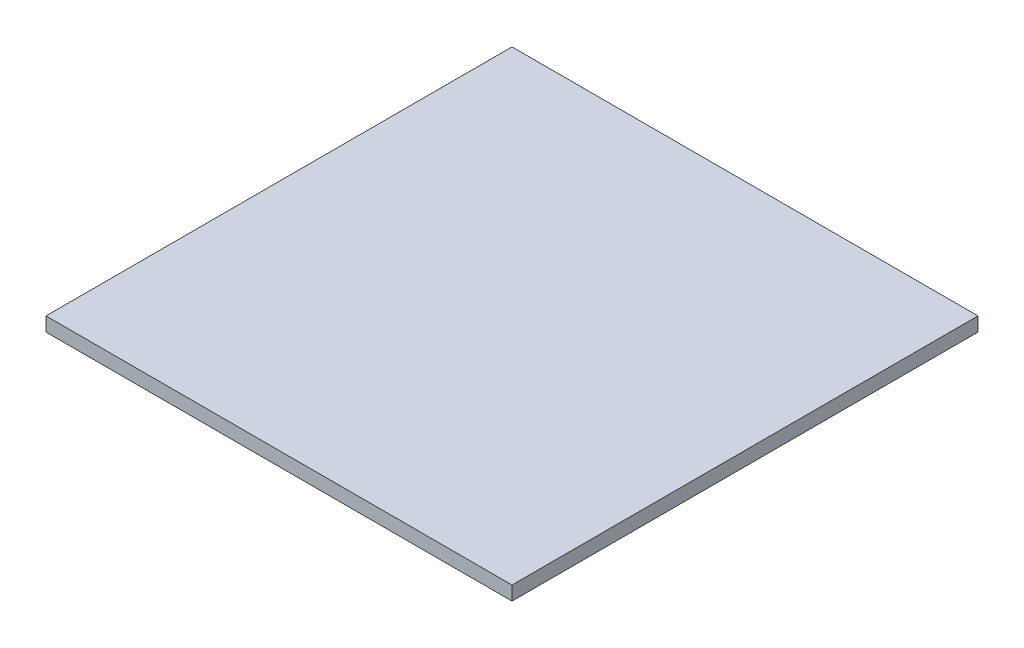
ISO-10303-21;
HEADER;
FILE_DESCRIPTION(('STEP AP214'),'2;1');
FILE_NAME('part.step','',(''),(''),'','','');
FILE_SCHEMA(('AUTOMOTIVE_DESIGN { 1 0 10303 214 1 1 1 1 }'));
ENDSEC;
DATA;
#1=APPLICATION_CONTEXT('core data for automotive mechanical design processes');
#2=APPLICATION_PROTOCOL_DEFINITION('international standard','automotive_design',2000,#1);
#3=PRODUCT_CONTEXT('',#1,'mechanical');
#4=PRODUCT('Part','Part','',(#3));
#5=PRODUCT_RELATED_PRODUCT_CATEGORY('part','',(#4));
#6=PRODUCT_DEFINITION_FORMATION('','',#4);
#7=PRODUCT_DEFINITION_CONTEXT('part definition',#1,'design');
#8=PRODUCT_DEFINITION('design','',#6,#7);
#9=PRODUCT_DEFINITION_SHAPE('','',#8);
#10=(LENGTH_UNIT() NAMED_UNIT(*) SI_UNIT(.MILLI.,.METRE.));
#11=(NAMED_UNIT(*) PLANE_ANGLE_UNIT() SI_UNIT($,.RADIAN.));
#12=(NAMED_UNIT(*) SI_UNIT($,.STERADIAN.) SOLID_ANGLE_UNIT());
#13=UNCERTAINTY_MEASURE_WITH_UNIT(LENGTH_MEASURE(1.E-05),#10,'distance_accuracy_value','');
#14=(GEOMETRIC_REPRESENTATION_CONTEXT(3) GLOBAL_UNCERTAINTY_ASSIGNED_CONTEXT((#13)) GLOBAL_UNIT_ASSIGNED_CONTEXT((#10,
#11,#12)) REPRESENTATION_CONTEXT('',''));
#15=CARTESIAN_POINT('',(0.,0.,0.));
#16=DIRECTION('',(0.,0.,1.));
#17=DIRECTION('',(1.,0.,0.));
#18=AXIS2_PLACEMENT_3D('',#15,#16,#17);
#19=CARTESIAN_POINT('',(50.,3.,50.));
#20=DIRECTION('',(-1.,0.,0.));
#21=DIRECTION('',(0.,0.,1.));
#22=AXIS2_PLACEMENT_3D('',#19,#20,#21);
#23=PLANE('',#22);
#24=DIRECTION('',(0.,0.,-1.));
#25=VECTOR('',#24,1.);
#26=CARTESIAN_POINT('',(50.,0.,50.));
#27=LINE('',#26,#25);
#28=CARTESIAN_POINT('',(50.,0.,50.));
#29=VERTEX_POINT('',#28);
#30=CARTESIAN_POINT('',(50.,0.,-50.));
#31=VERTEX_POINT('',#30);
#32=EDGE_CURVE('E96',#29,#31,#27,.T.);
#33=ORIENTED_EDGE('',*,*,#32,.T.);
#34=DIRECTION('',(0.,-1.,0.));
#35=VECTOR('',#34,1.);
#36=CARTESIAN_POINT('',(50.,3.,-50.));
#37=LINE('',#36,#35);
#38=CARTESIAN_POINT('',(50.,3.,-50.));
#39=VERTEX_POINT('',#38);
#40=EDGE_CURVE('E11',#39,#31,#37,.T.);
#41=ORIENTED_EDGE('',*,*,#40,.F.);
#42=DIRECTION('',(0.,0.,-1.));
#43=VECTOR('',#42,1.);
#44=CARTESIAN_POINT('',(50.,3.,50.));
#45=LINE('',#44,#43);
#46=CARTESIAN_POINT('',(50.,3.,50.));
#47=VERTEX_POINT('',#46);
#48=EDGE_CURVE('E84',#47,#39,#45,.T.);
#49=ORIENTED_EDGE('',*,*,#48,.F.);
#50=DIRECTION('',(0.,-1.,0.));
#51=VECTOR('',#50,1.);
#52=CARTESIAN_POINT('',(50.,3.,50.));
#53=LINE('',#52,#51);
#54=EDGE_CURVE('E92',#47,#29,#53,.T.);
#55=ORIENTED_EDGE('',*,*,#54,.T.);
#56=EDGE_LOOP('',(#33,#41,#49,#55));
#57=FACE_BOUND('',#56,.T.);
#58=ADVANCED_FACE('F33',(#57),#23,.F.);
#59=CARTESIAN_POINT('',(-50.,3.,-50.));
#60=DIRECTION('',(0.,0.,1.));
#61=DIRECTION('',(1.,0.,0.));
#62=AXIS2_PLACEMENT_3D('',#59,#60,#61);
#63=PLANE('',#62);
#64=DIRECTION('',(-1.,0.,0.));
#65=VECTOR('',#64,1.);
#66=CARTESIAN_POINT('',(-50.,0.,-50.));
#67=LINE('',#66,#65);
#68=CARTESIAN_POINT('',(-50.,0.,-50.));
#69=VERTEX_POINT('',#68);
#70=EDGE_CURVE('E88',#31,#69,#67,.T.);
#71=ORIENTED_EDGE('',*,*,#70,.T.);
#72=DIRECTION('',(0.,-1.,0.));
#73=VECTOR('',#72,1.);
#74=CARTESIAN_POINT('',(-50.,3.,-50.));
#75=LINE('',#74,#73);
#76=CARTESIAN_POINT('',(-50.,3.,-50.));
#77=VERTEX_POINT('',#76);
#78=EDGE_CURVE('E41',#77,#69,#75,.T.);
#79=ORIENTED_EDGE('',*,*,#78,.F.);
#80=DIRECTION('',(-1.,0.,0.));
#81=VECTOR('',#80,1.);
#82=CARTESIAN_POINT('',(-50.,3.,-50.));
#83=LINE('',#82,#81);
#84=EDGE_CURVE('E79',#39,#77,#83,.T.);
#85=ORIENTED_EDGE('',*,*,#84,.F.);
#86=ORIENTED_EDGE('',*,*,#40,.T.);
#87=EDGE_LOOP('',(#71,#79,#85,#86));
#88=FACE_BOUND('',#87,.T.);
#89=ADVANCED_FACE('F87',(#88),#63,.F.);
#90=CARTESIAN_POINT('',(-50.,3.,50.));
#91=DIRECTION('',(1.,0.,0.));
#92=DIRECTION('',(0.,0.,-1.));
#93=AXIS2_PLACEMENT_3D('',#90,#91,#92);
#94=PLANE('',#93);
#95=DIRECTION('',(0.,0.,1.));
#96=VECTOR('',#95,1.);
#97=CARTESIAN_POINT('',(-50.,0.,50.));
#98=LINE('',#97,#96);
#99=CARTESIAN_POINT('',(-50.,0.,50.));
#100=VERTEX_POINT('',#99);
#101=EDGE_CURVE('E66',#69,#100,#98,.T.);
#102=ORIENTED_EDGE('',*,*,#101,.T.);
#103=DIRECTION('',(0.,-1.,0.));
#104=VECTOR('',#103,1.);
#105=CARTESIAN_POINT('',(-50.,3.,50.));
#106=LINE('',#105,#104);
#107=CARTESIAN_POINT('',(-50.,3.,50.));
#108=VERTEX_POINT('',#107);
#109=EDGE_CURVE('E89',#108,#100,#106,.T.);
#110=ORIENTED_EDGE('',*,*,#109,.F.);
#111=DIRECTION('',(0.,0.,1.));
#112=VECTOR('',#111,1.);
#113=CARTESIAN_POINT('',(-50.,3.,50.));
#114=LINE('',#113,#112);
#115=EDGE_CURVE('E82',#77,#108,#114,.T.);
#116=ORIENTED_EDGE('',*,*,#115,.F.);
#117=ORIENTED_EDGE('',*,*,#78,.T.);
#118=EDGE_LOOP('',(#102,#110,#116,#117));
#119=FACE_BOUND('',#118,.T.);
#120=ADVANCED_FACE('F90',(#119),#94,.F.);
#121=CARTESIAN_POINT('',(-50.,3.,50.));
#122=DIRECTION('',(0.,0.,-1.));
#123=DIRECTION('',(-1.,0.,0.));
#124=AXIS2_PLACEMENT_3D('',#121,#122,#123);
#125=PLANE('',#124);
#126=DIRECTION('',(1.,0.,0.));
#127=VECTOR('',#126,1.);
#128=CARTESIAN_POINT('',(-50.,0.,50.));
#129=LINE('',#128,#127);
#130=EDGE_CURVE('E72',#100,#29,#129,.T.);
#131=ORIENTED_EDGE('',*,*,#130,.T.);
#132=ORIENTED_EDGE('',*,*,#54,.F.);
#133=DIRECTION('',(1.,0.,0.));
#134=VECTOR('',#133,1.);
#135=CARTESIAN_POINT('',(-50.,3.,50.));
#136=LINE('',#135,#134);
#137=EDGE_CURVE('E49',#108,#47,#136,.T.);
#138=ORIENTED_EDGE('',*,*,#137,.F.);
#139=ORIENTED_EDGE('',*,*,#109,.T.);
#140=EDGE_LOOP('',(#131,#132,#138,#139));
#141=FACE_BOUND('',#140,.T.);
#142=ADVANCED_FACE('F103',(#141),#125,.F.);
#143=CARTESIAN_POINT('',(0.,3.,0.));
#144=DIRECTION('',(0.,-1.,0.));
#145=DIRECTION('',(0.,0.,-1.));
#146=AXIS2_PLACEMENT_3D('',#143,#144,#145);
#147=PLANE('',#146);
#148=ORIENTED_EDGE('',*,*,#48,.T.);
#149=ORIENTED_EDGE('',*,*,#84,.T.);
#150=ORIENTED_EDGE('',*,*,#115,.T.);
#151=ORIENTED_EDGE('',*,*,#137,.T.);
#152=EDGE_LOOP('',(#148,#149,#150,#151));
#153=FACE_BOUND('',#152,.T.);
#154=ADVANCED_FACE('F80',(#153),#147,.F.);
#155=CARTESIAN_POINT('',(0.,0.,0.));
#156=DIRECTION('',(0.,-1.,0.));
#157=DIRECTION('',(0.,0.,-1.));
#158=AXIS2_PLACEMENT_3D('',#155,#156,#157);
#159=PLANE('',#158);
#160=ORIENTED_EDGE('',*,*,#32,.F.);
#161=ORIENTED_EDGE('',*,*,#130,.F.);
#162=ORIENTED_EDGE('',*,*,#101,.F.);
#163=ORIENTED_EDGE('',*,*,#70,.F.);
#164=EDGE_LOOP('',(#160,#161,#162,#163));
#165=FACE_BOUND('',#164,.T.);
#166=ADVANCED_FACE('F106',(#165),#159,.T.);
#167=CLOSED_SHELL('',(#58,#89,#120,#142,#154,#166));
#168=MANIFOLD_SOLID_BREP('B2',#167);
#169=ADVANCED_BREP_SHAPE_REPRESENTATION('',(#18,#168),#14);
#170=SHAPE_DEFINITION_REPRESENTATION(#9,#169);
ENDSEC;
END-ISO-10303-21;
